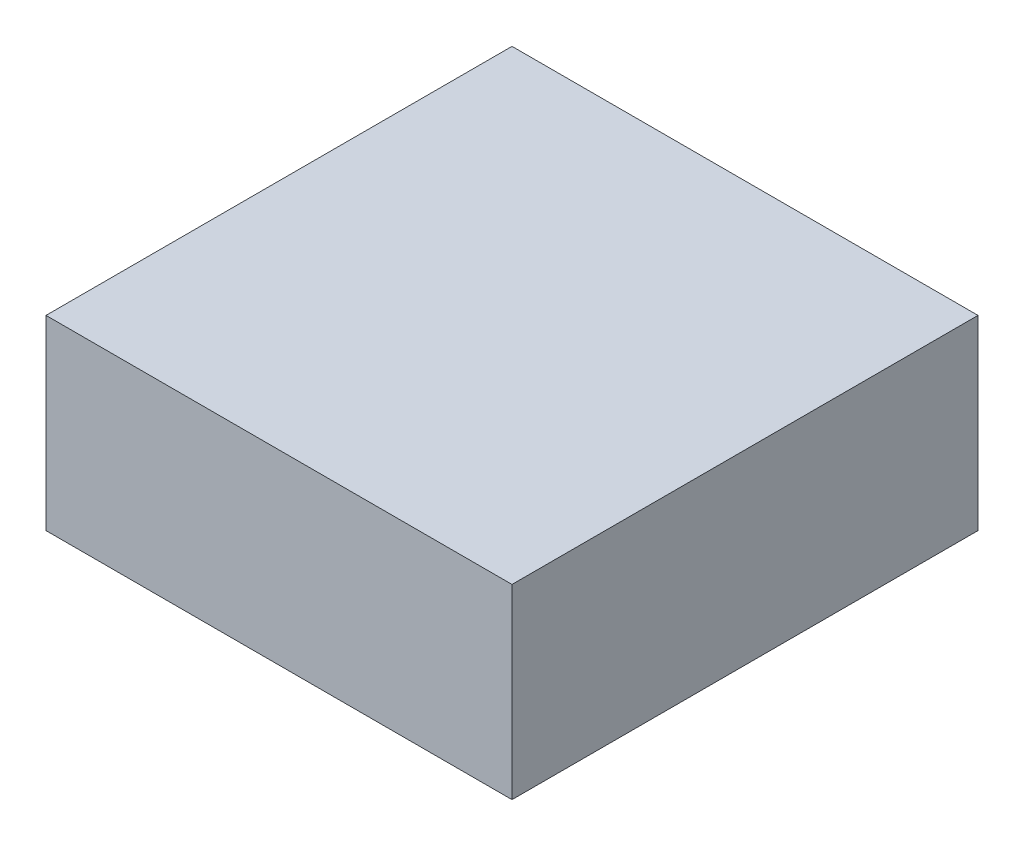
ISO-10303-21;
HEADER;
FILE_DESCRIPTION(('STEP AP214'),'2;1');
FILE_NAME('part.step','',(''),(''),'','','');
FILE_SCHEMA(('AUTOMOTIVE_DESIGN { 1 0 10303 214 1 1 1 1 }'));
ENDSEC;
DATA;
#1=APPLICATION_CONTEXT('core data for automotive mechanical design processes');
#2=APPLICATION_PROTOCOL_DEFINITION('international standard','automotive_design',2000,#1);
#3=PRODUCT_CONTEXT('',#1,'mechanical');
#4=PRODUCT('Part','Part','',(#3));
#5=PRODUCT_RELATED_PRODUCT_CATEGORY('part','',(#4));
#6=PRODUCT_DEFINITION_FORMATION('','',#4);
#7=PRODUCT_DEFINITION_CONTEXT('part definition',#1,'design');
#8=PRODUCT_DEFINITION('design','',#6,#7);
#9=PRODUCT_DEFINITION_SHAPE('','',#8);
#10=(LENGTH_UNIT() NAMED_UNIT(*) SI_UNIT(.MILLI.,.METRE.));
#11=(NAMED_UNIT(*) PLANE_ANGLE_UNIT() SI_UNIT($,.RADIAN.));
#12=(NAMED_UNIT(*) SI_UNIT($,.STERADIAN.) SOLID_ANGLE_UNIT());
#13=UNCERTAINTY_MEASURE_WITH_UNIT(LENGTH_MEASURE(1.E-05),#10,'distance_accuracy_value','');
#14=(GEOMETRIC_REPRESENTATION_CONTEXT(3) GLOBAL_UNCERTAINTY_ASSIGNED_CONTEXT((#13)) GLOBAL_UNIT_ASSIGNED_CONTEXT((#10,
#11,#12)) REPRESENTATION_CONTEXT('',''));
#15=CARTESIAN_POINT('',(0.,0.,0.));
#16=DIRECTION('',(0.,0.,1.));
#17=DIRECTION('',(1.,0.,0.));
#18=AXIS2_PLACEMENT_3D('',#15,#16,#17);
#19=CARTESIAN_POINT('',(63.5,50.8,63.5));
#20=DIRECTION('',(-1.,0.,0.));
#21=DIRECTION('',(0.,0.,1.));
#22=AXIS2_PLACEMENT_3D('',#19,#20,#21);
#23=PLANE('',#22);
#24=DIRECTION('',(0.,0.,-1.));
#25=VECTOR('',#24,1.);
#26=CARTESIAN_POINT('',(63.5,0.,63.5));
#27=LINE('',#26,#25);
#28=CARTESIAN_POINT('',(63.5,0.,63.5));
#29=VERTEX_POINT('',#28);
#30=CARTESIAN_POINT('',(63.5,0.,-63.5));
#31=VERTEX_POINT('',#30);
#32=EDGE_CURVE('E96',#29,#31,#27,.T.);
#33=ORIENTED_EDGE('',*,*,#32,.T.);
#34=DIRECTION('',(0.,-1.,0.));
#35=VECTOR('',#34,1.);
#36=CARTESIAN_POINT('',(63.5,50.8,-63.5));
#37=LINE('',#36,#35);
#38=CARTESIAN_POINT('',(63.5,50.8,-63.5));
#39=VERTEX_POINT('',#38);
#40=EDGE_CURVE('E11',#39,#31,#37,.T.);
#41=ORIENTED_EDGE('',*,*,#40,.F.);
#42=DIRECTION('',(0.,0.,-1.));
#43=VECTOR('',#42,1.);
#44=CARTESIAN_POINT('',(63.5,50.8,63.5));
#45=LINE('',#44,#43);
#46=CARTESIAN_POINT('',(63.5,50.8,63.5));
#47=VERTEX_POINT('',#46);
#48=EDGE_CURVE('E84',#47,#39,#45,.T.);
#49=ORIENTED_EDGE('',*,*,#48,.F.);
#50=DIRECTION('',(0.,-1.,0.));
#51=VECTOR('',#50,1.);
#52=CARTESIAN_POINT('',(63.5,50.8,63.5));
#53=LINE('',#52,#51);
#54=EDGE_CURVE('E92',#47,#29,#53,.T.);
#55=ORIENTED_EDGE('',*,*,#54,.T.);
#56=EDGE_LOOP('',(#33,#41,#49,#55));
#57=FACE_BOUND('',#56,.T.);
#58=ADVANCED_FACE('F33',(#57),#23,.F.);
#59=CARTESIAN_POINT('',(-63.5,50.8,-63.5));
#60=DIRECTION('',(0.,0.,1.));
#61=DIRECTION('',(1.,0.,0.));
#62=AXIS2_PLACEMENT_3D('',#59,#60,#61);
#63=PLANE('',#62);
#64=DIRECTION('',(-1.,0.,0.));
#65=VECTOR('',#64,1.);
#66=CARTESIAN_POINT('',(-63.5,0.,-63.5));
#67=LINE('',#66,#65);
#68=CARTESIAN_POINT('',(-63.5,0.,-63.5));
#69=VERTEX_POINT('',#68);
#70=EDGE_CURVE('E88',#31,#69,#67,.T.);
#71=ORIENTED_EDGE('',*,*,#70,.T.);
#72=DIRECTION('',(0.,-1.,0.));
#73=VECTOR('',#72,1.);
#74=CARTESIAN_POINT('',(-63.5,50.8,-63.5));
#75=LINE('',#74,#73);
#76=CARTESIAN_POINT('',(-63.5,50.8,-63.5));
#77=VERTEX_POINT('',#76);
#78=EDGE_CURVE('E41',#77,#69,#75,.T.);
#79=ORIENTED_EDGE('',*,*,#78,.F.);
#80=DIRECTION('',(-1.,0.,0.));
#81=VECTOR('',#80,1.);
#82=CARTESIAN_POINT('',(-63.5,50.8,-63.5));
#83=LINE('',#82,#81);
#84=EDGE_CURVE('E79',#39,#77,#83,.T.);
#85=ORIENTED_EDGE('',*,*,#84,.F.);
#86=ORIENTED_EDGE('',*,*,#40,.T.);
#87=EDGE_LOOP('',(#71,#79,#85,#86));
#88=FACE_BOUND('',#87,.T.);
#89=ADVANCED_FACE('F87',(#88),#63,.F.);
#90=CARTESIAN_POINT('',(-63.5,50.8,63.5));
#91=DIRECTION('',(1.,0.,0.));
#92=DIRECTION('',(0.,0.,-1.));
#93=AXIS2_PLACEMENT_3D('',#90,#91,#92);
#94=PLANE('',#93);
#95=DIRECTION('',(0.,0.,1.));
#96=VECTOR('',#95,1.);
#97=CARTESIAN_POINT('',(-63.5,0.,63.5));
#98=LINE('',#97,#96);
#99=CARTESIAN_POINT('',(-63.5,0.,63.5));
#100=VERTEX_POINT('',#99);
#101=EDGE_CURVE('E66',#69,#100,#98,.T.);
#102=ORIENTED_EDGE('',*,*,#101,.T.);
#103=DIRECTION('',(0.,-1.,0.));
#104=VECTOR('',#103,1.);
#105=CARTESIAN_POINT('',(-63.5,50.8,63.5));
#106=LINE('',#105,#104);
#107=CARTESIAN_POINT('',(-63.5,50.8,63.5));
#108=VERTEX_POINT('',#107);
#109=EDGE_CURVE('E89',#108,#100,#106,.T.);
#110=ORIENTED_EDGE('',*,*,#109,.F.);
#111=DIRECTION('',(0.,0.,1.));
#112=VECTOR('',#111,1.);
#113=CARTESIAN_POINT('',(-63.5,50.8,63.5));
#114=LINE('',#113,#112);
#115=EDGE_CURVE('E82',#77,#108,#114,.T.);
#116=ORIENTED_EDGE('',*,*,#115,.F.);
#117=ORIENTED_EDGE('',*,*,#78,.T.);
#118=EDGE_LOOP('',(#102,#110,#116,#117));
#119=FACE_BOUND('',#118,.T.);
#120=ADVANCED_FACE('F90',(#119),#94,.F.);
#121=CARTESIAN_POINT('',(-63.5,50.8,63.5));
#122=DIRECTION('',(0.,0.,-1.));
#123=DIRECTION('',(-1.,0.,0.));
#124=AXIS2_PLACEMENT_3D('',#121,#122,#123);
#125=PLANE('',#124);
#126=DIRECTION('',(1.,0.,0.));
#127=VECTOR('',#126,1.);
#128=CARTESIAN_POINT('',(-63.5,0.,63.5));
#129=LINE('',#128,#127);
#130=EDGE_CURVE('E72',#100,#29,#129,.T.);
#131=ORIENTED_EDGE('',*,*,#130,.T.);
#132=ORIENTED_EDGE('',*,*,#54,.F.);
#133=DIRECTION('',(1.,0.,0.));
#134=VECTOR('',#133,1.);
#135=CARTESIAN_POINT('',(-63.5,50.8,63.5));
#136=LINE('',#135,#134);
#137=EDGE_CURVE('E49',#108,#47,#136,.T.);
#138=ORIENTED_EDGE('',*,*,#137,.F.);
#139=ORIENTED_EDGE('',*,*,#109,.T.);
#140=EDGE_LOOP('',(#131,#132,#138,#139));
#141=FACE_BOUND('',#140,.T.);
#142=ADVANCED_FACE('F103',(#141),#125,.F.);
#143=CARTESIAN_POINT('',(0.,50.8,0.));
#144=DIRECTION('',(0.,-1.,0.));
#145=DIRECTION('',(0.,0.,-1.));
#146=AXIS2_PLACEMENT_3D('',#143,#144,#145);
#147=PLANE('',#146);
#148=ORIENTED_EDGE('',*,*,#48,.T.);
#149=ORIENTED_EDGE('',*,*,#84,.T.);
#150=ORIENTED_EDGE('',*,*,#115,.T.);
#151=ORIENTED_EDGE('',*,*,#137,.T.);
#152=EDGE_LOOP('',(#148,#149,#150,#151));
#153=FACE_BOUND('',#152,.T.);
#154=ADVANCED_FACE('F80',(#153),#147,.F.);
#155=CARTESIAN_POINT('',(0.,0.,0.));
#156=DIRECTION('',(0.,-1.,0.));
#157=DIRECTION('',(0.,0.,-1.));
#158=AXIS2_PLACEMENT_3D('',#155,#156,#157);
#159=PLANE('',#158);
#160=ORIENTED_EDGE('',*,*,#32,.F.);
#161=ORIENTED_EDGE('',*,*,#130,.F.);
#162=ORIENTED_EDGE('',*,*,#101,.F.);
#163=ORIENTED_EDGE('',*,*,#70,.F.);
#164=EDGE_LOOP('',(#160,#161,#162,#163));
#165=FACE_BOUND('',#164,.T.);
#166=ADVANCED_FACE('F106',(#165),#159,.T.);
#167=CLOSED_SHELL('',(#58,#89,#120,#142,#154,#166));
#168=MANIFOLD_SOLID_BREP('B2',#167);
#169=ADVANCED_BREP_SHAPE_REPRESENTATION('',(#18,#168),#14);
#170=SHAPE_DEFINITION_REPRESENTATION(#9,#169);
ENDSEC;
END-ISO-10303-21;
